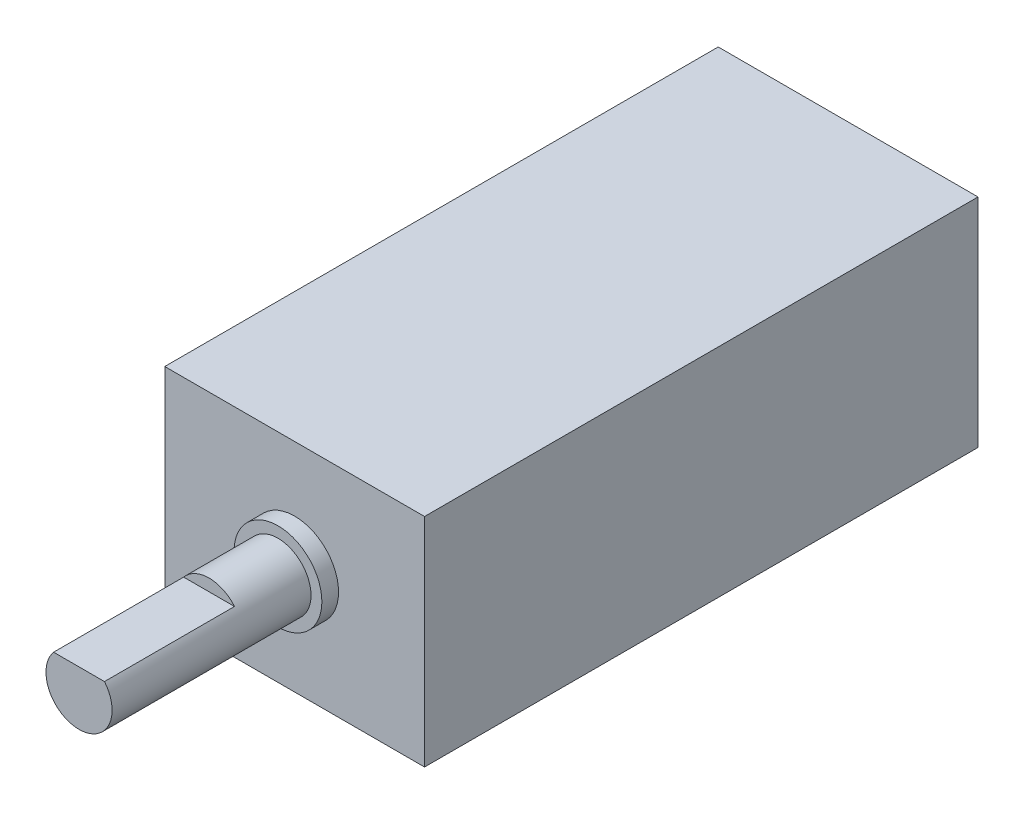
ISO-10303-21;
HEADER;
FILE_DESCRIPTION(('STEP AP214'),'2;1');
FILE_NAME('part.step','',(''),(''),'','','');
FILE_SCHEMA(('AUTOMOTIVE_DESIGN { 1 0 10303 214 1 1 1 1 }'));
ENDSEC;
DATA;
#1=APPLICATION_CONTEXT('core data for automotive mechanical design processes');
#2=APPLICATION_PROTOCOL_DEFINITION('international standard','automotive_design',2000,#1);
#3=PRODUCT_CONTEXT('',#1,'mechanical');
#4=PRODUCT('Part','Part','',(#3));
#5=PRODUCT_RELATED_PRODUCT_CATEGORY('part','',(#4));
#6=PRODUCT_DEFINITION_FORMATION('','',#4);
#7=PRODUCT_DEFINITION_CONTEXT('part definition',#1,'design');
#8=PRODUCT_DEFINITION('design','',#6,#7);
#9=PRODUCT_DEFINITION_SHAPE('','',#8);
#10=(LENGTH_UNIT() NAMED_UNIT(*) SI_UNIT(.MILLI.,.METRE.));
#11=(NAMED_UNIT(*) PLANE_ANGLE_UNIT() SI_UNIT($,.RADIAN.));
#12=(NAMED_UNIT(*) SI_UNIT($,.STERADIAN.) SOLID_ANGLE_UNIT());
#13=UNCERTAINTY_MEASURE_WITH_UNIT(LENGTH_MEASURE(1.E-05),#10,'distance_accuracy_value','');
#14=(GEOMETRIC_REPRESENTATION_CONTEXT(3) GLOBAL_UNCERTAINTY_ASSIGNED_CONTEXT((#13)) GLOBAL_UNIT_ASSIGNED_CONTEXT((#10,
#11,#12)) REPRESENTATION_CONTEXT('',''));
#15=CARTESIAN_POINT('',(0.,0.,0.));
#16=DIRECTION('',(0.,0.,1.));
#17=DIRECTION('',(1.,0.,0.));
#18=AXIS2_PLACEMENT_3D('',#15,#16,#17);
#19=CARTESIAN_POINT('',(5.93725,-4.95935,-25.2984));
#20=DIRECTION('',(1.,0.,0.));
#21=DIRECTION('',(0.,0.,-1.));
#22=AXIS2_PLACEMENT_3D('',#19,#20,#21);
#23=PLANE('',#22);
#24=DIRECTION('',(0.,1.,0.));
#25=VECTOR('',#24,1.);
#26=CARTESIAN_POINT('',(5.93725,-4.95935,0.));
#27=LINE('',#26,#25);
#28=CARTESIAN_POINT('',(5.93725,-4.95935,0.));
#29=VERTEX_POINT('',#28);
#30=CARTESIAN_POINT('',(5.93725,4.95935,0.));
#31=VERTEX_POINT('',#30);
#32=EDGE_CURVE('E131',#29,#31,#27,.T.);
#33=ORIENTED_EDGE('',*,*,#32,.F.);
#34=DIRECTION('',(0.,0.,1.));
#35=VECTOR('',#34,1.);
#36=CARTESIAN_POINT('',(5.93725,-4.95935,-25.2984));
#37=LINE('',#36,#35);
#38=CARTESIAN_POINT('',(5.93725,-4.95935,-25.2984));
#39=VERTEX_POINT('',#38);
#40=EDGE_CURVE('E70',#39,#29,#37,.T.);
#41=ORIENTED_EDGE('',*,*,#40,.F.);
#42=DIRECTION('',(0.,1.,0.));
#43=VECTOR('',#42,1.);
#44=CARTESIAN_POINT('',(5.93725,-4.95935,-25.2984));
#45=LINE('',#44,#43);
#46=CARTESIAN_POINT('',(5.93725,4.95935,-25.2984));
#47=VERTEX_POINT('',#46);
#48=EDGE_CURVE('E134',#39,#47,#45,.T.);
#49=ORIENTED_EDGE('',*,*,#48,.T.);
#50=DIRECTION('',(0.,0.,1.));
#51=VECTOR('',#50,1.);
#52=CARTESIAN_POINT('',(5.93725,4.95935,-25.2984));
#53=LINE('',#52,#51);
#54=EDGE_CURVE('E48',#47,#31,#53,.T.);
#55=ORIENTED_EDGE('',*,*,#54,.T.);
#56=EDGE_LOOP('',(#33,#41,#49,#55));
#57=FACE_BOUND('',#56,.T.);
#58=ADVANCED_FACE('F45',(#57),#23,.T.);
#59=CARTESIAN_POINT('',(-5.93725,-4.95935,-25.2984));
#60=DIRECTION('',(0.,-1.,0.));
#61=DIRECTION('',(0.,0.,-1.));
#62=AXIS2_PLACEMENT_3D('',#59,#60,#61);
#63=PLANE('',#62);
#64=DIRECTION('',(1.,0.,0.));
#65=VECTOR('',#64,1.);
#66=CARTESIAN_POINT('',(-5.93725,-4.95935,0.));
#67=LINE('',#66,#65);
#68=CARTESIAN_POINT('',(-5.93725,-4.95935,0.));
#69=VERTEX_POINT('',#68);
#70=EDGE_CURVE('E137',#69,#29,#67,.T.);
#71=ORIENTED_EDGE('',*,*,#70,.F.);
#72=DIRECTION('',(0.,0.,1.));
#73=VECTOR('',#72,1.);
#74=CARTESIAN_POINT('',(-5.93725,-4.95935,-25.2984));
#75=LINE('',#74,#73);
#76=CARTESIAN_POINT('',(-5.93725,-4.95935,-25.2984));
#77=VERTEX_POINT('',#76);
#78=EDGE_CURVE('E155',#77,#69,#75,.T.);
#79=ORIENTED_EDGE('',*,*,#78,.F.);
#80=DIRECTION('',(1.,0.,0.));
#81=VECTOR('',#80,1.);
#82=CARTESIAN_POINT('',(-5.93725,-4.95935,-25.2984));
#83=LINE('',#82,#81);
#84=EDGE_CURVE('E142',#77,#39,#83,.T.);
#85=ORIENTED_EDGE('',*,*,#84,.T.);
#86=ORIENTED_EDGE('',*,*,#40,.T.);
#87=EDGE_LOOP('',(#71,#79,#85,#86));
#88=FACE_BOUND('',#87,.T.);
#89=ADVANCED_FACE('F161',(#88),#63,.T.);
#90=CARTESIAN_POINT('',(-5.93725,-4.95935,-25.2984));
#91=DIRECTION('',(-1.,0.,0.));
#92=DIRECTION('',(0.,0.,1.));
#93=AXIS2_PLACEMENT_3D('',#90,#91,#92);
#94=PLANE('',#93);
#95=DIRECTION('',(0.,-1.,0.));
#96=VECTOR('',#95,1.);
#97=CARTESIAN_POINT('',(-5.93725,-4.95935,0.));
#98=LINE('',#97,#96);
#99=CARTESIAN_POINT('',(-5.93725,4.95935,0.));
#100=VERTEX_POINT('',#99);
#101=EDGE_CURVE('E149',#100,#69,#98,.T.);
#102=ORIENTED_EDGE('',*,*,#101,.F.);
#103=DIRECTION('',(0.,0.,1.));
#104=VECTOR('',#103,1.);
#105=CARTESIAN_POINT('',(-5.93725,4.95935,-25.2984));
#106=LINE('',#105,#104);
#107=CARTESIAN_POINT('',(-5.93725,4.95935,-25.2984));
#108=VERTEX_POINT('',#107);
#109=EDGE_CURVE('E156',#108,#100,#106,.T.);
#110=ORIENTED_EDGE('',*,*,#109,.F.);
#111=DIRECTION('',(0.,-1.,0.));
#112=VECTOR('',#111,1.);
#113=CARTESIAN_POINT('',(-5.93725,-4.95935,-25.2984));
#114=LINE('',#113,#112);
#115=EDGE_CURVE('E139',#108,#77,#114,.T.);
#116=ORIENTED_EDGE('',*,*,#115,.T.);
#117=ORIENTED_EDGE('',*,*,#78,.T.);
#118=EDGE_LOOP('',(#102,#110,#116,#117));
#119=FACE_BOUND('',#118,.T.);
#120=ADVANCED_FACE('F165',(#119),#94,.T.);
#121=CARTESIAN_POINT('',(-5.93725,4.95935,-25.2984));
#122=DIRECTION('',(0.,1.,0.));
#123=DIRECTION('',(0.,0.,1.));
#124=AXIS2_PLACEMENT_3D('',#121,#122,#123);
#125=PLANE('',#124);
#126=DIRECTION('',(-1.,0.,0.));
#127=VECTOR('',#126,1.);
#128=CARTESIAN_POINT('',(-5.93725,4.95935,0.));
#129=LINE('',#128,#127);
#130=EDGE_CURVE('E146',#31,#100,#129,.T.);
#131=ORIENTED_EDGE('',*,*,#130,.F.);
#132=ORIENTED_EDGE('',*,*,#54,.F.);
#133=DIRECTION('',(-1.,0.,0.));
#134=VECTOR('',#133,1.);
#135=CARTESIAN_POINT('',(-5.93725,4.95935,-25.2984));
#136=LINE('',#135,#134);
#137=EDGE_CURVE('E136',#47,#108,#136,.T.);
#138=ORIENTED_EDGE('',*,*,#137,.T.);
#139=ORIENTED_EDGE('',*,*,#109,.T.);
#140=EDGE_LOOP('',(#131,#132,#138,#139));
#141=FACE_BOUND('',#140,.T.);
#142=ADVANCED_FACE('F158',(#141),#125,.T.);
#143=CARTESIAN_POINT('',(0.,0.,-25.2984));
#144=DIRECTION('',(0.,0.,-1.));
#145=DIRECTION('',(-1.,0.,0.));
#146=AXIS2_PLACEMENT_3D('',#143,#144,#145);
#147=PLANE('',#146);
#148=ORIENTED_EDGE('',*,*,#48,.F.);
#149=ORIENTED_EDGE('',*,*,#84,.F.);
#150=ORIENTED_EDGE('',*,*,#115,.F.);
#151=ORIENTED_EDGE('',*,*,#137,.F.);
#152=EDGE_LOOP('',(#148,#149,#150,#151));
#153=FACE_BOUND('',#152,.T.);
#154=ADVANCED_FACE('F167',(#153),#147,.T.);
#155=CARTESIAN_POINT('',(0.,0.,0.));
#156=DIRECTION('',(0.,0.,-1.));
#157=DIRECTION('',(-1.,0.,0.));
#158=AXIS2_PLACEMENT_3D('',#155,#156,#157);
#159=PLANE('',#158);
#160=CARTESIAN_POINT('',(0.,0.,0.));
#161=DIRECTION('',(0.,0.,1.));
#162=DIRECTION('',(1.,0.,0.));
#163=AXIS2_PLACEMENT_3D('',#160,#161,#162);
#164=CIRCLE('',#163,2.0066);
#165=CARTESIAN_POINT('',(2.0066,0.,0.));
#166=VERTEX_POINT('',#165);
#167=EDGE_CURVE('E53',#166,#166,#164,.T.);
#168=ORIENTED_EDGE('',*,*,#167,.F.);
#169=EDGE_LOOP('',(#168));
#170=FACE_BOUND('',#169,.T.);
#171=ORIENTED_EDGE('',*,*,#32,.T.);
#172=ORIENTED_EDGE('',*,*,#130,.T.);
#173=ORIENTED_EDGE('',*,*,#101,.T.);
#174=ORIENTED_EDGE('',*,*,#70,.T.);
#175=EDGE_LOOP('',(#171,#172,#173,#174));
#176=FACE_BOUND('',#175,.T.);
#177=ADVANCED_FACE('F160',(#170,#176),#159,.F.);
#178=CARTESIAN_POINT('',(0.,0.,0.762));
#179=DIRECTION('',(0.,0.,-1.));
#180=DIRECTION('',(-1.,0.,0.));
#181=AXIS2_PLACEMENT_3D('',#178,#179,#180);
#182=CYLINDRICAL_SURFACE('',#181,2.0066);
#183=CARTESIAN_POINT('',(0.,0.,0.762));
#184=DIRECTION('',(0.,0.,1.));
#185=DIRECTION('',(1.,0.,0.));
#186=AXIS2_PLACEMENT_3D('',#183,#184,#185);
#187=CIRCLE('',#186,2.0066);
#188=CARTESIAN_POINT('',(2.0066,0.,0.762));
#189=VERTEX_POINT('',#188);
#190=EDGE_CURVE('E127',#189,#189,#187,.T.);
#191=ORIENTED_EDGE('',*,*,#190,.F.);
#192=EDGE_LOOP('',(#191));
#193=FACE_BOUND('',#192,.T.);
#194=ORIENTED_EDGE('',*,*,#167,.T.);
#195=EDGE_LOOP('',(#194));
#196=FACE_BOUND('',#195,.T.);
#197=ADVANCED_FACE('F174',(#193,#196),#182,.T.);
#198=CARTESIAN_POINT('',(0.,0.,0.762));
#199=DIRECTION('',(0.,0.,1.));
#200=DIRECTION('',(1.,0.,0.));
#201=AXIS2_PLACEMENT_3D('',#198,#199,#200);
#202=PLANE('',#201);
#203=CARTESIAN_POINT('',(0.,0.,0.762));
#204=DIRECTION('',(0.,0.,1.));
#205=DIRECTION('',(1.,0.,0.));
#206=AXIS2_PLACEMENT_3D('',#203,#204,#205);
#207=CIRCLE('',#206,1.5113);
#208=CARTESIAN_POINT('',(1.5113,0.,0.762));
#209=VERTEX_POINT('',#208);
#210=EDGE_CURVE('E11',#209,#209,#207,.T.);
#211=ORIENTED_EDGE('',*,*,#210,.F.);
#212=EDGE_LOOP('',(#211));
#213=FACE_BOUND('',#212,.T.);
#214=ORIENTED_EDGE('',*,*,#190,.T.);
#215=EDGE_LOOP('',(#214));
#216=FACE_BOUND('',#215,.T.);
#217=ADVANCED_FACE('F214',(#213,#216),#202,.T.);
#218=CARTESIAN_POINT('',(0.,0.,9.8552));
#219=DIRECTION('',(0.,0.,-1.));
#220=DIRECTION('',(-1.,0.,0.));
#221=AXIS2_PLACEMENT_3D('',#218,#219,#220);
#222=CYLINDRICAL_SURFACE('',#221,1.5113);
#223=CARTESIAN_POINT('',(0.,0.,9.8552));
#224=DIRECTION('',(0.,0.,1.));
#225=DIRECTION('',(1.,0.,0.));
#226=AXIS2_PLACEMENT_3D('',#223,#224,#225);
#227=CIRCLE('',#226,1.5113);
#228=CARTESIAN_POINT('',(-1.16293449944526,0.9652,9.8552));
#229=VERTEX_POINT('',#228);
#230=CARTESIAN_POINT('',(1.16293449944526,0.9652,9.8552));
#231=VERTEX_POINT('',#230);
#232=EDGE_CURVE('E122',#229,#231,#227,.T.);
#233=ORIENTED_EDGE('',*,*,#232,.F.);
#234=DIRECTION('',(0.,0.,1.));
#235=VECTOR('',#234,1.);
#236=CARTESIAN_POINT('',(-1.16293449944526,0.9652,3.9116));
#237=LINE('',#236,#235);
#238=CARTESIAN_POINT('',(-1.16293449944526,0.9652,3.9116));
#239=VERTEX_POINT('',#238);
#240=EDGE_CURVE('E61',#239,#229,#237,.T.);
#241=ORIENTED_EDGE('',*,*,#240,.F.);
#242=CARTESIAN_POINT('',(0.,0.,3.9116));
#243=DIRECTION('',(0.,0.,1.));
#244=DIRECTION('',(1.,0.,0.));
#245=AXIS2_PLACEMENT_3D('',#242,#243,#244);
#246=CIRCLE('',#245,1.5113);
#247=CARTESIAN_POINT('',(1.16293449944526,0.9652,3.9116));
#248=VERTEX_POINT('',#247);
#249=EDGE_CURVE('E108',#248,#239,#246,.T.);
#250=ORIENTED_EDGE('',*,*,#249,.F.);
#251=DIRECTION('',(0.,0.,1.));
#252=VECTOR('',#251,1.);
#253=CARTESIAN_POINT('',(1.16293449944526,0.9652,3.9116));
#254=LINE('',#253,#252);
#255=EDGE_CURVE('E116',#248,#231,#254,.T.);
#256=ORIENTED_EDGE('',*,*,#255,.T.);
#257=EDGE_LOOP('',(#233,#241,#250,#256));
#258=FACE_BOUND('',#257,.T.);
#259=ORIENTED_EDGE('',*,*,#210,.T.);
#260=EDGE_LOOP('',(#259));
#261=FACE_BOUND('',#260,.T.);
#262=ADVANCED_FACE('F119',(#258,#261),#222,.T.);
#263=CARTESIAN_POINT('',(0.,0.,9.8552));
#264=DIRECTION('',(0.,0.,1.));
#265=DIRECTION('',(1.,0.,0.));
#266=AXIS2_PLACEMENT_3D('',#263,#264,#265);
#267=PLANE('',#266);
#268=DIRECTION('',(1.,0.,0.));
#269=VECTOR('',#268,1.);
#270=CARTESIAN_POINT('',(0.,0.9652,9.8552));
#271=LINE('',#270,#269);
#272=EDGE_CURVE('E113',#229,#231,#271,.T.);
#273=ORIENTED_EDGE('',*,*,#272,.F.);
#274=ORIENTED_EDGE('',*,*,#232,.T.);
#275=EDGE_LOOP('',(#273,#274));
#276=FACE_BOUND('',#275,.T.);
#277=ADVANCED_FACE('F213',(#276),#267,.T.);
#278=CARTESIAN_POINT('',(0.,0.9652,3.9116));
#279=DIRECTION('',(0.,-1.,0.));
#280=DIRECTION('',(0.,0.,-1.));
#281=AXIS2_PLACEMENT_3D('',#278,#279,#280);
#282=PLANE('',#281);
#283=ORIENTED_EDGE('',*,*,#272,.T.);
#284=ORIENTED_EDGE('',*,*,#255,.F.);
#285=DIRECTION('',(1.,0.,0.));
#286=VECTOR('',#285,1.);
#287=CARTESIAN_POINT('',(0.,0.9652,3.9116));
#288=LINE('',#287,#286);
#289=EDGE_CURVE('E110',#239,#248,#288,.T.);
#290=ORIENTED_EDGE('',*,*,#289,.F.);
#291=ORIENTED_EDGE('',*,*,#240,.T.);
#292=EDGE_LOOP('',(#283,#284,#290,#291));
#293=FACE_BOUND('',#292,.T.);
#294=ADVANCED_FACE('F115',(#293),#282,.F.);
#295=CARTESIAN_POINT('',(0.,0.,3.9116));
#296=DIRECTION('',(0.,0.,1.));
#297=DIRECTION('',(1.,0.,0.));
#298=AXIS2_PLACEMENT_3D('',#295,#296,#297);
#299=PLANE('',#298);
#300=ORIENTED_EDGE('',*,*,#249,.T.);
#301=ORIENTED_EDGE('',*,*,#289,.T.);
#302=EDGE_LOOP('',(#300,#301));
#303=FACE_BOUND('',#302,.T.);
#304=ADVANCED_FACE('F109',(#303),#299,.T.);
#305=CLOSED_SHELL('',(#58,#89,#120,#142,#154,#177,#197,#217,#262,#277,#294,#304));
#306=MANIFOLD_SOLID_BREP('B2',#305);
#307=ADVANCED_BREP_SHAPE_REPRESENTATION('',(#18,#306),#14);
#308=SHAPE_DEFINITION_REPRESENTATION(#9,#307);
ENDSEC;
END-ISO-10303-21;
